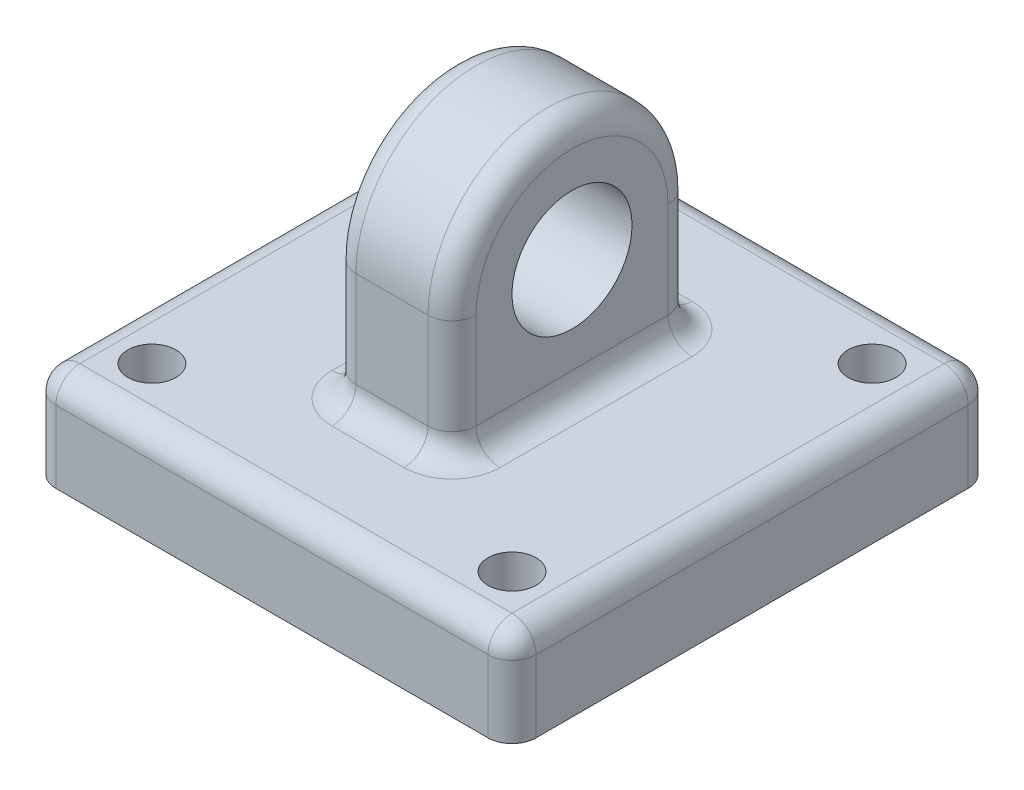
ISO-10303-21;
HEADER;
FILE_DESCRIPTION(('STEP AP214'),'2;1');
FILE_NAME('part.step','',(''),(''),'','','');
FILE_SCHEMA(('AUTOMOTIVE_DESIGN { 1 0 10303 214 1 1 1 1 }'));
ENDSEC;
DATA;
#1=APPLICATION_CONTEXT('core data for automotive mechanical design processes');
#2=APPLICATION_PROTOCOL_DEFINITION('international standard','automotive_design',2000,#1);
#3=PRODUCT_CONTEXT('',#1,'mechanical');
#4=PRODUCT('Part','Part','',(#3));
#5=PRODUCT_RELATED_PRODUCT_CATEGORY('part','',(#4));
#6=PRODUCT_DEFINITION_FORMATION('','',#4);
#7=PRODUCT_DEFINITION_CONTEXT('part definition',#1,'design');
#8=PRODUCT_DEFINITION('design','',#6,#7);
#9=PRODUCT_DEFINITION_SHAPE('','',#8);
#10=(LENGTH_UNIT() NAMED_UNIT(*) SI_UNIT(.MILLI.,.METRE.));
#11=(NAMED_UNIT(*) PLANE_ANGLE_UNIT() SI_UNIT($,.RADIAN.));
#12=(NAMED_UNIT(*) SI_UNIT($,.STERADIAN.) SOLID_ANGLE_UNIT());
#13=UNCERTAINTY_MEASURE_WITH_UNIT(LENGTH_MEASURE(1.E-05),#10,'distance_accuracy_value','');
#14=(GEOMETRIC_REPRESENTATION_CONTEXT(3) GLOBAL_UNCERTAINTY_ASSIGNED_CONTEXT((#13)) GLOBAL_UNIT_ASSIGNED_CONTEXT((#10,
#11,#12)) REPRESENTATION_CONTEXT('',''));
#15=CARTESIAN_POINT('',(0.,0.,0.));
#16=DIRECTION('',(0.,0.,1.));
#17=DIRECTION('',(1.,0.,0.));
#18=AXIS2_PLACEMENT_3D('',#15,#16,#17);
#19=CARTESIAN_POINT('',(0.,-5.,0.));
#20=DIRECTION('',(0.,1.,0.));
#21=DIRECTION('',(0.,0.,1.));
#22=AXIS2_PLACEMENT_3D('',#19,#20,#21);
#23=PLANE('',#22);
#24=CARTESIAN_POINT('',(7.5,-5.,7.5));
#25=DIRECTION('',(0.,1.,0.));
#26=DIRECTION('',(0.,0.,1.));
#27=AXIS2_PLACEMENT_3D('',#24,#25,#26);
#28=CIRCLE('',#27,1.);
#29=CARTESIAN_POINT('',(7.5,-5.,8.5));
#30=VERTEX_POINT('',#29);
#31=EDGE_CURVE('E408',#30,#30,#28,.T.);
#32=ORIENTED_EDGE('',*,*,#31,.F.);
#33=EDGE_LOOP('',(#32));
#34=FACE_BOUND('',#33,.T.);
#35=CARTESIAN_POINT('',(7.5,-5.,-7.5));
#36=DIRECTION('',(0.,1.,0.));
#37=DIRECTION('',(0.,0.,1.));
#38=AXIS2_PLACEMENT_3D('',#35,#36,#37);
#39=CIRCLE('',#38,1.);
#40=CARTESIAN_POINT('',(7.5,-5.,-6.5));
#41=VERTEX_POINT('',#40);
#42=EDGE_CURVE('E895',#41,#41,#39,.T.);
#43=ORIENTED_EDGE('',*,*,#42,.F.);
#44=EDGE_LOOP('',(#43));
#45=FACE_BOUND('',#44,.T.);
#46=CARTESIAN_POINT('',(-7.5,-5.,-7.5));
#47=DIRECTION('',(0.,1.,0.));
#48=DIRECTION('',(0.,0.,1.));
#49=AXIS2_PLACEMENT_3D('',#46,#47,#48);
#50=CIRCLE('',#49,1.);
#51=CARTESIAN_POINT('',(-7.5,-5.,-6.5));
#52=VERTEX_POINT('',#51);
#53=EDGE_CURVE('E901',#52,#52,#50,.T.);
#54=ORIENTED_EDGE('',*,*,#53,.F.);
#55=EDGE_LOOP('',(#54));
#56=FACE_BOUND('',#55,.T.);
#57=CARTESIAN_POINT('',(-7.5,-5.,7.5));
#58=DIRECTION('',(0.,1.,0.));
#59=DIRECTION('',(0.,0.,1.));
#60=AXIS2_PLACEMENT_3D('',#57,#58,#59);
#61=CIRCLE('',#60,1.);
#62=CARTESIAN_POINT('',(-7.5,-5.,8.5));
#63=VERTEX_POINT('',#62);
#64=EDGE_CURVE('E349',#63,#63,#61,.T.);
#65=ORIENTED_EDGE('',*,*,#64,.F.);
#66=EDGE_LOOP('',(#65));
#67=FACE_BOUND('',#66,.T.);
#68=DIRECTION('',(0.,0.,1.));
#69=VECTOR('',#68,1.);
#70=CARTESIAN_POINT('',(9.,-5.,-10.));
#71=LINE('',#70,#69);
#72=CARTESIAN_POINT('',(9.,-5.,9.));
#73=VERTEX_POINT('',#72);
#74=CARTESIAN_POINT('',(9.,-5.,-9.));
#75=VERTEX_POINT('',#74);
#76=EDGE_CURVE('E230',#73,#75,#71,.F.);
#77=ORIENTED_EDGE('',*,*,#76,.T.);
#78=DIRECTION('',(1.,0.,0.));
#79=VECTOR('',#78,1.);
#80=CARTESIAN_POINT('',(-10.,-5.,-9.));
#81=LINE('',#80,#79);
#82=CARTESIAN_POINT('',(-9.,-5.,-9.));
#83=VERTEX_POINT('',#82);
#84=EDGE_CURVE('E236',#75,#83,#81,.F.);
#85=ORIENTED_EDGE('',*,*,#84,.T.);
#86=DIRECTION('',(0.,0.,-1.));
#87=VECTOR('',#86,1.);
#88=CARTESIAN_POINT('',(-9.,-5.,10.));
#89=LINE('',#88,#87);
#90=CARTESIAN_POINT('',(-9.,-5.,9.));
#91=VERTEX_POINT('',#90);
#92=EDGE_CURVE('E234',#83,#91,#89,.F.);
#93=ORIENTED_EDGE('',*,*,#92,.T.);
#94=DIRECTION('',(-1.,0.,0.));
#95=VECTOR('',#94,1.);
#96=CARTESIAN_POINT('',(10.,-5.,9.));
#97=LINE('',#96,#95);
#98=EDGE_CURVE('E232',#91,#73,#97,.F.);
#99=ORIENTED_EDGE('',*,*,#98,.T.);
#100=EDGE_LOOP('',(#77,#85,#93,#99));
#101=FACE_BOUND('',#100,.T.);
#102=CARTESIAN_POINT('',(-1.5,-5.,-4.));
#103=DIRECTION('',(0.,1.,0.));
#104=DIRECTION('',(0.,0.,1.));
#105=AXIS2_PLACEMENT_3D('',#102,#103,#104);
#106=CIRCLE('',#105,2.);
#107=CARTESIAN_POINT('',(-1.5,-5.,-6.));
#108=VERTEX_POINT('',#107);
#109=CARTESIAN_POINT('',(-3.5,-5.,-4.));
#110=VERTEX_POINT('',#109);
#111=EDGE_CURVE('E257',#108,#110,#106,.T.);
#112=ORIENTED_EDGE('',*,*,#111,.F.);
#113=DIRECTION('',(-1.,0.,0.));
#114=VECTOR('',#113,1.);
#115=CARTESIAN_POINT('',(0.,-5.,-6.));
#116=LINE('',#115,#114);
#117=CARTESIAN_POINT('',(1.5,-5.,-6.));
#118=VERTEX_POINT('',#117);
#119=EDGE_CURVE('E254',#108,#118,#116,.F.);
#120=ORIENTED_EDGE('',*,*,#119,.T.);
#121=CARTESIAN_POINT('',(1.5,-5.,-4.));
#122=DIRECTION('',(0.,1.,0.));
#123=DIRECTION('',(0.,0.,1.));
#124=AXIS2_PLACEMENT_3D('',#121,#122,#123);
#125=CIRCLE('',#124,2.);
#126=CARTESIAN_POINT('',(3.5,-5.,-4.));
#127=VERTEX_POINT('',#126);
#128=EDGE_CURVE('E251',#127,#118,#125,.T.);
#129=ORIENTED_EDGE('',*,*,#128,.F.);
#130=DIRECTION('',(0.,0.,-1.));
#131=VECTOR('',#130,1.);
#132=CARTESIAN_POINT('',(3.5,-5.,5.));
#133=LINE('',#132,#131);
#134=CARTESIAN_POINT('',(3.5,-5.,4.));
#135=VERTEX_POINT('',#134);
#136=EDGE_CURVE('E249',#127,#135,#133,.F.);
#137=ORIENTED_EDGE('',*,*,#136,.T.);
#138=CARTESIAN_POINT('',(1.5,-5.,4.));
#139=DIRECTION('',(0.,1.,0.));
#140=DIRECTION('',(0.,0.,1.));
#141=AXIS2_PLACEMENT_3D('',#138,#139,#140);
#142=CIRCLE('',#141,2.);
#143=CARTESIAN_POINT('',(1.5,-5.,6.));
#144=VERTEX_POINT('',#143);
#145=EDGE_CURVE('E246',#144,#135,#142,.T.);
#146=ORIENTED_EDGE('',*,*,#145,.F.);
#147=DIRECTION('',(-1.,0.,0.));
#148=VECTOR('',#147,1.);
#149=CARTESIAN_POINT('',(0.,-5.,6.));
#150=LINE('',#149,#148);
#151=CARTESIAN_POINT('',(-1.5,-5.,6.));
#152=VERTEX_POINT('',#151);
#153=EDGE_CURVE('E242',#144,#152,#150,.T.);
#154=ORIENTED_EDGE('',*,*,#153,.T.);
#155=CARTESIAN_POINT('',(-1.5,-5.,4.));
#156=DIRECTION('',(0.,1.,0.));
#157=DIRECTION('',(0.,0.,1.));
#158=AXIS2_PLACEMENT_3D('',#155,#156,#157);
#159=CIRCLE('',#158,2.);
#160=CARTESIAN_POINT('',(-3.5,-5.,4.));
#161=VERTEX_POINT('',#160);
#162=EDGE_CURVE('E239',#161,#152,#159,.T.);
#163=ORIENTED_EDGE('',*,*,#162,.F.);
#164=DIRECTION('',(0.,0.,-1.));
#165=VECTOR('',#164,1.);
#166=CARTESIAN_POINT('',(-3.5,-5.,0.));
#167=LINE('',#166,#165);
#168=EDGE_CURVE('E244',#161,#110,#167,.T.);
#169=ORIENTED_EDGE('',*,*,#168,.T.);
#170=EDGE_LOOP('',(#112,#120,#129,#137,#146,#154,#163,#169));
#171=FACE_BOUND('',#170,.T.);
#172=ADVANCED_FACE('F37',(#34,#45,#56,#67,#101,#171),#23,.T.);
#173=CARTESIAN_POINT('',(2.5,0.,0.));
#174=DIRECTION('',(1.,0.,0.));
#175=DIRECTION('',(0.,0.,-1.));
#176=AXIS2_PLACEMENT_3D('',#173,#174,#175);
#177=PLANE('',#176);
#178=DIRECTION('',(0.,-1.,0.));
#179=VECTOR('',#178,1.);
#180=CARTESIAN_POINT('',(2.5,-5.,4.));
#181=LINE('',#180,#179);
#182=CARTESIAN_POINT('',(2.5,0.,4.));
#183=VERTEX_POINT('',#182);
#184=CARTESIAN_POINT('',(2.5,-4.,4.));
#185=VERTEX_POINT('',#184);
#186=EDGE_CURVE('E260',#183,#185,#181,.T.);
#187=ORIENTED_EDGE('',*,*,#186,.T.);
#188=DIRECTION('',(0.,0.,-1.));
#189=VECTOR('',#188,1.);
#190=CARTESIAN_POINT('',(2.5,-4.,-5.));
#191=LINE('',#190,#189);
#192=CARTESIAN_POINT('',(2.5,-4.,-4.));
#193=VERTEX_POINT('',#192);
#194=EDGE_CURVE('E265',#185,#193,#191,.T.);
#195=ORIENTED_EDGE('',*,*,#194,.T.);
#196=DIRECTION('',(0.,1.,0.));
#197=VECTOR('',#196,1.);
#198=CARTESIAN_POINT('',(2.5,0.,-4.));
#199=LINE('',#198,#197);
#200=CARTESIAN_POINT('',(2.5,0.,-4.));
#201=VERTEX_POINT('',#200);
#202=EDGE_CURVE('E263',#193,#201,#199,.T.);
#203=ORIENTED_EDGE('',*,*,#202,.T.);
#204=CARTESIAN_POINT('',(2.5,0.,0.));
#205=DIRECTION('',(1.,0.,0.));
#206=DIRECTION('',(0.,0.,-1.));
#207=AXIS2_PLACEMENT_3D('',#204,#205,#206);
#208=CIRCLE('',#207,4.);
#209=EDGE_CURVE('E215',#201,#183,#208,.T.);
#210=ORIENTED_EDGE('',*,*,#209,.T.);
#211=EDGE_LOOP('',(#187,#195,#203,#210));
#212=FACE_BOUND('',#211,.T.);
#213=CARTESIAN_POINT('',(2.5,0.,0.));
#214=DIRECTION('',(1.,0.,0.));
#215=DIRECTION('',(0.,0.,-1.));
#216=AXIS2_PLACEMENT_3D('',#213,#214,#215);
#217=CIRCLE('',#216,2.5);
#218=CARTESIAN_POINT('',(2.5,0.,-2.5));
#219=VERTEX_POINT('',#218);
#220=EDGE_CURVE('E209',#219,#219,#217,.T.);
#221=ORIENTED_EDGE('',*,*,#220,.F.);
#222=EDGE_LOOP('',(#221));
#223=FACE_BOUND('',#222,.T.);
#224=ADVANCED_FACE('F437',(#212,#223),#177,.T.);
#225=CARTESIAN_POINT('',(-2.5,0.,0.));
#226=DIRECTION('',(1.,0.,0.));
#227=DIRECTION('',(0.,0.,-1.));
#228=AXIS2_PLACEMENT_3D('',#225,#226,#227);
#229=PLANE('',#228);
#230=DIRECTION('',(0.,1.,0.));
#231=VECTOR('',#230,1.);
#232=CARTESIAN_POINT('',(-2.5,0.,-4.));
#233=LINE('',#232,#231);
#234=CARTESIAN_POINT('',(-2.5,0.,-4.));
#235=VERTEX_POINT('',#234);
#236=CARTESIAN_POINT('',(-2.5,-4.,-4.));
#237=VERTEX_POINT('',#236);
#238=EDGE_CURVE('E272',#235,#237,#233,.F.);
#239=ORIENTED_EDGE('',*,*,#238,.T.);
#240=DIRECTION('',(0.,0.,-1.));
#241=VECTOR('',#240,1.);
#242=CARTESIAN_POINT('',(-2.5,-4.,0.));
#243=LINE('',#242,#241);
#244=CARTESIAN_POINT('',(-2.5,-4.,4.));
#245=VERTEX_POINT('',#244);
#246=EDGE_CURVE('E199',#237,#245,#243,.F.);
#247=ORIENTED_EDGE('',*,*,#246,.T.);
#248=DIRECTION('',(0.,-1.,0.));
#249=VECTOR('',#248,1.);
#250=CARTESIAN_POINT('',(-2.5,0.,4.));
#251=LINE('',#250,#249);
#252=CARTESIAN_POINT('',(-2.5,0.,4.));
#253=VERTEX_POINT('',#252);
#254=EDGE_CURVE('E268',#245,#253,#251,.F.);
#255=ORIENTED_EDGE('',*,*,#254,.T.);
#256=CARTESIAN_POINT('',(-2.5,0.,0.));
#257=DIRECTION('',(1.,0.,0.));
#258=DIRECTION('',(0.,0.,-1.));
#259=AXIS2_PLACEMENT_3D('',#256,#257,#258);
#260=CIRCLE('',#259,4.);
#261=EDGE_CURVE('E270',#253,#235,#260,.F.);
#262=ORIENTED_EDGE('',*,*,#261,.T.);
#263=EDGE_LOOP('',(#239,#247,#255,#262));
#264=FACE_BOUND('',#263,.T.);
#265=CARTESIAN_POINT('',(-2.5,0.,0.));
#266=DIRECTION('',(1.,0.,0.));
#267=DIRECTION('',(0.,0.,-1.));
#268=AXIS2_PLACEMENT_3D('',#265,#266,#267);
#269=CIRCLE('',#268,2.5);
#270=CARTESIAN_POINT('',(-2.5,0.,-2.5));
#271=VERTEX_POINT('',#270);
#272=EDGE_CURVE('E415',#271,#271,#269,.T.);
#273=ORIENTED_EDGE('',*,*,#272,.T.);
#274=EDGE_LOOP('',(#273));
#275=FACE_BOUND('',#274,.T.);
#276=ADVANCED_FACE('F421',(#264,#275),#229,.F.);
#277=CARTESIAN_POINT('',(2.5,0.,0.));
#278=DIRECTION('',(-1.,0.,0.));
#279=DIRECTION('',(0.,0.,1.));
#280=AXIS2_PLACEMENT_3D('',#277,#278,#279);
#281=CYLINDRICAL_SURFACE('',#280,5.);
#282=DIRECTION('',(-1.,0.,0.));
#283=VECTOR('',#282,1.);
#284=CARTESIAN_POINT('',(2.5,0.,-5.));
#285=LINE('',#284,#283);
#286=CARTESIAN_POINT('',(1.5,0.,-5.));
#287=VERTEX_POINT('',#286);
#288=CARTESIAN_POINT('',(-1.5,0.,-5.));
#289=VERTEX_POINT('',#288);
#290=EDGE_CURVE('E190',#287,#289,#285,.T.);
#291=ORIENTED_EDGE('',*,*,#290,.T.);
#292=CARTESIAN_POINT('',(-1.5,0.,0.));
#293=DIRECTION('',(1.,0.,0.));
#294=DIRECTION('',(0.,0.,-1.));
#295=AXIS2_PLACEMENT_3D('',#292,#293,#294);
#296=CIRCLE('',#295,5.);
#297=CARTESIAN_POINT('',(-1.5,0.,5.));
#298=VERTEX_POINT('',#297);
#299=EDGE_CURVE('E198',#289,#298,#296,.T.);
#300=ORIENTED_EDGE('',*,*,#299,.T.);
#301=DIRECTION('',(-1.,0.,0.));
#302=VECTOR('',#301,1.);
#303=CARTESIAN_POINT('',(2.5,0.,5.));
#304=LINE('',#303,#302);
#305=CARTESIAN_POINT('',(1.5,0.,5.));
#306=VERTEX_POINT('',#305);
#307=EDGE_CURVE('E193',#306,#298,#304,.T.);
#308=ORIENTED_EDGE('',*,*,#307,.F.);
#309=CARTESIAN_POINT('',(1.5,0.,0.));
#310=DIRECTION('',(1.,0.,0.));
#311=DIRECTION('',(0.,0.,-1.));
#312=AXIS2_PLACEMENT_3D('',#309,#310,#311);
#313=CIRCLE('',#312,5.);
#314=EDGE_CURVE('E187',#306,#287,#313,.F.);
#315=ORIENTED_EDGE('',*,*,#314,.T.);
#316=EDGE_LOOP('',(#291,#300,#308,#315));
#317=FACE_BOUND('',#316,.T.);
#318=ADVANCED_FACE('F189',(#317),#281,.T.);
#319=CARTESIAN_POINT('',(2.5,0.,5.));
#320=DIRECTION('',(0.,0.,-1.));
#321=DIRECTION('',(0.,1.,0.));
#322=AXIS2_PLACEMENT_3D('',#319,#320,#321);
#323=PLANE('',#322);
#324=ORIENTED_EDGE('',*,*,#307,.T.);
#325=DIRECTION('',(0.,-1.,0.));
#326=VECTOR('',#325,1.);
#327=CARTESIAN_POINT('',(-1.5,0.,5.));
#328=LINE('',#327,#326);
#329=CARTESIAN_POINT('',(-1.5,-4.,5.));
#330=VERTEX_POINT('',#329);
#331=EDGE_CURVE('E281',#298,#330,#328,.T.);
#332=ORIENTED_EDGE('',*,*,#331,.T.);
#333=DIRECTION('',(-1.,0.,0.));
#334=VECTOR('',#333,1.);
#335=CARTESIAN_POINT('',(2.5,-4.,5.));
#336=LINE('',#335,#334);
#337=CARTESIAN_POINT('',(1.5,-4.,5.));
#338=VERTEX_POINT('',#337);
#339=EDGE_CURVE('E279',#330,#338,#336,.F.);
#340=ORIENTED_EDGE('',*,*,#339,.T.);
#341=DIRECTION('',(0.,-1.,0.));
#342=VECTOR('',#341,1.);
#343=CARTESIAN_POINT('',(1.5,0.,5.));
#344=LINE('',#343,#342);
#345=EDGE_CURVE('E277',#338,#306,#344,.F.);
#346=ORIENTED_EDGE('',*,*,#345,.T.);
#347=EDGE_LOOP('',(#324,#332,#340,#346));
#348=FACE_BOUND('',#347,.T.);
#349=ADVANCED_FACE('F433',(#348),#323,.F.);
#350=CARTESIAN_POINT('',(2.5,0.,-5.));
#351=DIRECTION('',(0.,0.,1.));
#352=DIRECTION('',(1.,0.,0.));
#353=AXIS2_PLACEMENT_3D('',#350,#351,#352);
#354=PLANE('',#353);
#355=DIRECTION('',(-1.,0.,0.));
#356=VECTOR('',#355,1.);
#357=CARTESIAN_POINT('',(2.5,-4.,-5.));
#358=LINE('',#357,#356);
#359=CARTESIAN_POINT('',(1.5,-4.,-5.));
#360=VERTEX_POINT('',#359);
#361=CARTESIAN_POINT('',(-1.5,-4.,-5.));
#362=VERTEX_POINT('',#361);
#363=EDGE_CURVE('E224',#360,#362,#358,.T.);
#364=ORIENTED_EDGE('',*,*,#363,.T.);
#365=DIRECTION('',(0.,1.,0.));
#366=VECTOR('',#365,1.);
#367=CARTESIAN_POINT('',(-1.5,0.,-5.));
#368=LINE('',#367,#366);
#369=EDGE_CURVE('E208',#362,#289,#368,.T.);
#370=ORIENTED_EDGE('',*,*,#369,.T.);
#371=ORIENTED_EDGE('',*,*,#290,.F.);
#372=DIRECTION('',(0.,1.,0.));
#373=VECTOR('',#372,1.);
#374=CARTESIAN_POINT('',(1.5,-5.,-5.));
#375=LINE('',#374,#373);
#376=EDGE_CURVE('E205',#287,#360,#375,.F.);
#377=ORIENTED_EDGE('',*,*,#376,.T.);
#378=EDGE_LOOP('',(#364,#370,#371,#377));
#379=FACE_BOUND('',#378,.T.);
#380=ADVANCED_FACE('F203',(#379),#354,.F.);
#381=CARTESIAN_POINT('',(2.5,0.,0.));
#382=DIRECTION('',(-1.,0.,0.));
#383=DIRECTION('',(0.,0.,1.));
#384=AXIS2_PLACEMENT_3D('',#381,#382,#383);
#385=CYLINDRICAL_SURFACE('',#384,2.5);
#386=ORIENTED_EDGE('',*,*,#220,.T.);
#387=EDGE_LOOP('',(#386));
#388=FACE_BOUND('',#387,.T.);
#389=ORIENTED_EDGE('',*,*,#272,.F.);
#390=EDGE_LOOP('',(#389));
#391=FACE_BOUND('',#390,.T.);
#392=ADVANCED_FACE('F423',(#388,#391),#385,.F.);
#393=CARTESIAN_POINT('',(-10.,-9.,-10.));
#394=DIRECTION('',(1.,0.,0.));
#395=DIRECTION('',(0.,0.,-1.));
#396=AXIS2_PLACEMENT_3D('',#393,#394,#395);
#397=PLANE('',#396);
#398=DIRECTION('',(0.,0.,-1.));
#399=VECTOR('',#398,1.);
#400=CARTESIAN_POINT('',(-10.,-9.,-10.));
#401=LINE('',#400,#399);
#402=CARTESIAN_POINT('',(-10.,-9.,9.));
#403=VERTEX_POINT('',#402);
#404=CARTESIAN_POINT('',(-10.,-9.,-9.));
#405=VERTEX_POINT('',#404);
#406=EDGE_CURVE('E394',#403,#405,#401,.T.);
#407=ORIENTED_EDGE('',*,*,#406,.F.);
#408=DIRECTION('',(0.,1.,0.));
#409=VECTOR('',#408,1.);
#410=CARTESIAN_POINT('',(-10.,-9.,9.));
#411=LINE('',#410,#409);
#412=CARTESIAN_POINT('',(-10.,-6.,9.));
#413=VERTEX_POINT('',#412);
#414=EDGE_CURVE('E308',#403,#413,#411,.T.);
#415=ORIENTED_EDGE('',*,*,#414,.T.);
#416=DIRECTION('',(0.,0.,-1.));
#417=VECTOR('',#416,1.);
#418=CARTESIAN_POINT('',(-10.,-6.,-10.));
#419=LINE('',#418,#417);
#420=CARTESIAN_POINT('',(-10.,-6.,-9.));
#421=VERTEX_POINT('',#420);
#422=EDGE_CURVE('E304',#413,#421,#419,.T.);
#423=ORIENTED_EDGE('',*,*,#422,.T.);
#424=DIRECTION('',(0.,1.,0.));
#425=VECTOR('',#424,1.);
#426=CARTESIAN_POINT('',(-10.,-9.,-9.));
#427=LINE('',#426,#425);
#428=EDGE_CURVE('E306',#421,#405,#427,.F.);
#429=ORIENTED_EDGE('',*,*,#428,.T.);
#430=EDGE_LOOP('',(#407,#415,#423,#429));
#431=FACE_BOUND('',#430,.T.);
#432=ADVANCED_FACE('F393',(#431),#397,.F.);
#433=CARTESIAN_POINT('',(-10.,-9.,-10.));
#434=DIRECTION('',(0.,0.,1.));
#435=DIRECTION('',(1.,0.,0.));
#436=AXIS2_PLACEMENT_3D('',#433,#434,#435);
#437=PLANE('',#436);
#438=DIRECTION('',(1.,0.,0.));
#439=VECTOR('',#438,1.);
#440=CARTESIAN_POINT('',(-10.,-9.,-10.));
#441=LINE('',#440,#439);
#442=CARTESIAN_POINT('',(-9.,-9.,-10.));
#443=VERTEX_POINT('',#442);
#444=CARTESIAN_POINT('',(9.,-9.,-10.));
#445=VERTEX_POINT('',#444);
#446=EDGE_CURVE('E402',#443,#445,#441,.T.);
#447=ORIENTED_EDGE('',*,*,#446,.F.);
#448=DIRECTION('',(0.,1.,0.));
#449=VECTOR('',#448,1.);
#450=CARTESIAN_POINT('',(-9.,-9.,-10.));
#451=LINE('',#450,#449);
#452=CARTESIAN_POINT('',(-9.,-6.,-10.));
#453=VERTEX_POINT('',#452);
#454=EDGE_CURVE('E11',#443,#453,#451,.T.);
#455=ORIENTED_EDGE('',*,*,#454,.T.);
#456=DIRECTION('',(1.,0.,0.));
#457=VECTOR('',#456,1.);
#458=CARTESIAN_POINT('',(10.,-6.,-10.));
#459=LINE('',#458,#457);
#460=CARTESIAN_POINT('',(9.,-6.,-10.));
#461=VERTEX_POINT('',#460);
#462=EDGE_CURVE('E53',#453,#461,#459,.T.);
#463=ORIENTED_EDGE('',*,*,#462,.T.);
#464=DIRECTION('',(0.,1.,0.));
#465=VECTOR('',#464,1.);
#466=CARTESIAN_POINT('',(9.,-9.,-10.));
#467=LINE('',#466,#465);
#468=EDGE_CURVE('E46',#461,#445,#467,.F.);
#469=ORIENTED_EDGE('',*,*,#468,.T.);
#470=EDGE_LOOP('',(#447,#455,#463,#469));
#471=FACE_BOUND('',#470,.T.);
#472=ADVANCED_FACE('F431',(#471),#437,.F.);
#473=CARTESIAN_POINT('',(10.,-9.,-10.));
#474=DIRECTION('',(-1.,0.,0.));
#475=DIRECTION('',(0.,0.,1.));
#476=AXIS2_PLACEMENT_3D('',#473,#474,#475);
#477=PLANE('',#476);
#478=DIRECTION('',(0.,0.,1.));
#479=VECTOR('',#478,1.);
#480=CARTESIAN_POINT('',(10.,-6.,10.));
#481=LINE('',#480,#479);
#482=CARTESIAN_POINT('',(10.,-6.,-9.));
#483=VERTEX_POINT('',#482);
#484=CARTESIAN_POINT('',(10.,-6.,9.));
#485=VERTEX_POINT('',#484);
#486=EDGE_CURVE('E290',#483,#485,#481,.T.);
#487=ORIENTED_EDGE('',*,*,#486,.T.);
#488=DIRECTION('',(0.,1.,0.));
#489=VECTOR('',#488,1.);
#490=CARTESIAN_POINT('',(10.,-9.,9.));
#491=LINE('',#490,#489);
#492=CARTESIAN_POINT('',(10.,-9.,9.));
#493=VERTEX_POINT('',#492);
#494=EDGE_CURVE('E294',#485,#493,#491,.F.);
#495=ORIENTED_EDGE('',*,*,#494,.T.);
#496=DIRECTION('',(0.,0.,1.));
#497=VECTOR('',#496,1.);
#498=CARTESIAN_POINT('',(10.,-9.,-10.));
#499=LINE('',#498,#497);
#500=CARTESIAN_POINT('',(10.,-9.,-9.));
#501=VERTEX_POINT('',#500);
#502=EDGE_CURVE('E405',#501,#493,#499,.T.);
#503=ORIENTED_EDGE('',*,*,#502,.F.);
#504=DIRECTION('',(0.,1.,0.));
#505=VECTOR('',#504,1.);
#506=CARTESIAN_POINT('',(10.,-9.,-9.));
#507=LINE('',#506,#505);
#508=EDGE_CURVE('E292',#501,#483,#507,.T.);
#509=ORIENTED_EDGE('',*,*,#508,.T.);
#510=EDGE_LOOP('',(#487,#495,#503,#509));
#511=FACE_BOUND('',#510,.T.);
#512=ADVANCED_FACE('F452',(#511),#477,.F.);
#513=CARTESIAN_POINT('',(-10.,-9.,10.));
#514=DIRECTION('',(0.,0.,-1.));
#515=DIRECTION('',(-1.,0.,0.));
#516=AXIS2_PLACEMENT_3D('',#513,#514,#515);
#517=PLANE('',#516);
#518=DIRECTION('',(-1.,0.,0.));
#519=VECTOR('',#518,1.);
#520=CARTESIAN_POINT('',(-10.,-9.,10.));
#521=LINE('',#520,#519);
#522=CARTESIAN_POINT('',(9.,-9.,10.));
#523=VERTEX_POINT('',#522);
#524=CARTESIAN_POINT('',(-9.,-9.,10.));
#525=VERTEX_POINT('',#524);
#526=EDGE_CURVE('E413',#523,#525,#521,.T.);
#527=ORIENTED_EDGE('',*,*,#526,.F.);
#528=DIRECTION('',(0.,1.,0.));
#529=VECTOR('',#528,1.);
#530=CARTESIAN_POINT('',(9.,-9.,10.));
#531=LINE('',#530,#529);
#532=CARTESIAN_POINT('',(9.,-6.,10.));
#533=VERTEX_POINT('',#532);
#534=EDGE_CURVE('E287',#523,#533,#531,.T.);
#535=ORIENTED_EDGE('',*,*,#534,.T.);
#536=DIRECTION('',(-1.,0.,0.));
#537=VECTOR('',#536,1.);
#538=CARTESIAN_POINT('',(-10.,-6.,10.));
#539=LINE('',#538,#537);
#540=CARTESIAN_POINT('',(-9.,-6.,10.));
#541=VERTEX_POINT('',#540);
#542=EDGE_CURVE('E283',#533,#541,#539,.T.);
#543=ORIENTED_EDGE('',*,*,#542,.T.);
#544=DIRECTION('',(0.,1.,0.));
#545=VECTOR('',#544,1.);
#546=CARTESIAN_POINT('',(-9.,-9.,10.));
#547=LINE('',#546,#545);
#548=EDGE_CURVE('E285',#541,#525,#547,.F.);
#549=ORIENTED_EDGE('',*,*,#548,.T.);
#550=EDGE_LOOP('',(#527,#535,#543,#549));
#551=FACE_BOUND('',#550,.T.);
#552=ADVANCED_FACE('F449',(#551),#517,.F.);
#553=CARTESIAN_POINT('',(0.,-9.,0.));
#554=DIRECTION('',(0.,1.,0.));
#555=DIRECTION('',(0.,0.,1.));
#556=AXIS2_PLACEMENT_3D('',#553,#554,#555);
#557=PLANE('',#556);
#558=CARTESIAN_POINT('',(-7.5,-9.,7.5));
#559=DIRECTION('',(0.,1.,0.));
#560=DIRECTION('',(0.,0.,1.));
#561=AXIS2_PLACEMENT_3D('',#558,#559,#560);
#562=CIRCLE('',#561,1.);
#563=CARTESIAN_POINT('',(-7.5,-9.,8.5));
#564=VERTEX_POINT('',#563);
#565=EDGE_CURVE('E883',#564,#564,#562,.F.);
#566=ORIENTED_EDGE('',*,*,#565,.F.);
#567=EDGE_LOOP('',(#566));
#568=FACE_BOUND('',#567,.T.);
#569=CARTESIAN_POINT('',(-7.5,-9.,-7.5));
#570=DIRECTION('',(0.,1.,0.));
#571=DIRECTION('',(0.,0.,1.));
#572=AXIS2_PLACEMENT_3D('',#569,#570,#571);
#573=CIRCLE('',#572,1.);
#574=CARTESIAN_POINT('',(-7.5,-9.,-6.5));
#575=VERTEX_POINT('',#574);
#576=EDGE_CURVE('E887',#575,#575,#573,.F.);
#577=ORIENTED_EDGE('',*,*,#576,.F.);
#578=EDGE_LOOP('',(#577));
#579=FACE_BOUND('',#578,.T.);
#580=CARTESIAN_POINT('',(7.5,-9.,-7.5));
#581=DIRECTION('',(0.,1.,0.));
#582=DIRECTION('',(0.,0.,1.));
#583=AXIS2_PLACEMENT_3D('',#580,#581,#582);
#584=CIRCLE('',#583,1.);
#585=CARTESIAN_POINT('',(7.5,-9.,-6.5));
#586=VERTEX_POINT('',#585);
#587=EDGE_CURVE('E891',#586,#586,#584,.F.);
#588=ORIENTED_EDGE('',*,*,#587,.F.);
#589=EDGE_LOOP('',(#588));
#590=FACE_BOUND('',#589,.T.);
#591=CARTESIAN_POINT('',(7.5,-9.,7.5));
#592=DIRECTION('',(0.,1.,0.));
#593=DIRECTION('',(0.,0.,1.));
#594=AXIS2_PLACEMENT_3D('',#591,#592,#593);
#595=CIRCLE('',#594,1.);
#596=CARTESIAN_POINT('',(7.5,-9.,8.5));
#597=VERTEX_POINT('',#596);
#598=EDGE_CURVE('E403',#597,#597,#595,.F.);
#599=ORIENTED_EDGE('',*,*,#598,.F.);
#600=EDGE_LOOP('',(#599));
#601=FACE_BOUND('',#600,.T.);
#602=ORIENTED_EDGE('',*,*,#502,.T.);
#603=CARTESIAN_POINT('',(9.,-9.,9.));
#604=DIRECTION('',(0.,1.,0.));
#605=DIRECTION('',(0.,0.,1.));
#606=AXIS2_PLACEMENT_3D('',#603,#604,#605);
#607=CIRCLE('',#606,1.);
#608=EDGE_CURVE('E302',#493,#523,#607,.F.);
#609=ORIENTED_EDGE('',*,*,#608,.T.);
#610=ORIENTED_EDGE('',*,*,#526,.T.);
#611=CARTESIAN_POINT('',(-9.,-9.,9.));
#612=DIRECTION('',(0.,1.,0.));
#613=DIRECTION('',(0.,0.,1.));
#614=AXIS2_PLACEMENT_3D('',#611,#612,#613);
#615=CIRCLE('',#614,1.);
#616=EDGE_CURVE('E300',#525,#403,#615,.F.);
#617=ORIENTED_EDGE('',*,*,#616,.T.);
#618=ORIENTED_EDGE('',*,*,#406,.T.);
#619=CARTESIAN_POINT('',(-9.,-9.,-9.));
#620=DIRECTION('',(0.,1.,0.));
#621=DIRECTION('',(0.,0.,1.));
#622=AXIS2_PLACEMENT_3D('',#619,#620,#621);
#623=CIRCLE('',#622,1.);
#624=EDGE_CURVE('E298',#405,#443,#623,.F.);
#625=ORIENTED_EDGE('',*,*,#624,.T.);
#626=ORIENTED_EDGE('',*,*,#446,.T.);
#627=CARTESIAN_POINT('',(9.,-9.,-9.));
#628=DIRECTION('',(0.,1.,0.));
#629=DIRECTION('',(0.,0.,1.));
#630=AXIS2_PLACEMENT_3D('',#627,#628,#629);
#631=CIRCLE('',#630,1.);
#632=EDGE_CURVE('E296',#445,#501,#631,.F.);
#633=ORIENTED_EDGE('',*,*,#632,.T.);
#634=EDGE_LOOP('',(#602,#609,#610,#617,#618,#625,#626,#633));
#635=FACE_BOUND('',#634,.T.);
#636=ADVANCED_FACE('F398',(#568,#579,#590,#601,#635),#557,.F.);
#637=CARTESIAN_POINT('',(7.5,-9.001,7.5));
#638=DIRECTION('',(0.,1.,0.));
#639=DIRECTION('',(0.,0.,1.));
#640=AXIS2_PLACEMENT_3D('',#637,#638,#639);
#641=CYLINDRICAL_SURFACE('',#640,1.);
#642=ORIENTED_EDGE('',*,*,#31,.T.);
#643=EDGE_LOOP('',(#642));
#644=FACE_BOUND('',#643,.T.);
#645=ORIENTED_EDGE('',*,*,#598,.T.);
#646=EDGE_LOOP('',(#645));
#647=FACE_BOUND('',#646,.T.);
#648=ADVANCED_FACE('F757',(#644,#647),#641,.F.);
#649=CARTESIAN_POINT('',(7.5,-9.001,-7.5));
#650=DIRECTION('',(0.,1.,0.));
#651=DIRECTION('',(0.,0.,1.));
#652=AXIS2_PLACEMENT_3D('',#649,#650,#651);
#653=CYLINDRICAL_SURFACE('',#652,1.);
#654=ORIENTED_EDGE('',*,*,#42,.T.);
#655=EDGE_LOOP('',(#654));
#656=FACE_BOUND('',#655,.T.);
#657=ORIENTED_EDGE('',*,*,#587,.T.);
#658=EDGE_LOOP('',(#657));
#659=FACE_BOUND('',#658,.T.);
#660=ADVANCED_FACE('F748',(#656,#659),#653,.F.);
#661=CARTESIAN_POINT('',(-7.5,-9.001,-7.5));
#662=DIRECTION('',(0.,1.,0.));
#663=DIRECTION('',(0.,0.,1.));
#664=AXIS2_PLACEMENT_3D('',#661,#662,#663);
#665=CYLINDRICAL_SURFACE('',#664,1.);
#666=ORIENTED_EDGE('',*,*,#53,.T.);
#667=EDGE_LOOP('',(#666));
#668=FACE_BOUND('',#667,.T.);
#669=ORIENTED_EDGE('',*,*,#576,.T.);
#670=EDGE_LOOP('',(#669));
#671=FACE_BOUND('',#670,.T.);
#672=ADVANCED_FACE('F739',(#668,#671),#665,.F.);
#673=CARTESIAN_POINT('',(-7.5,-9.001,7.5));
#674=DIRECTION('',(0.,1.,0.));
#675=DIRECTION('',(0.,0.,1.));
#676=AXIS2_PLACEMENT_3D('',#673,#674,#675);
#677=CYLINDRICAL_SURFACE('',#676,1.);
#678=ORIENTED_EDGE('',*,*,#64,.T.);
#679=EDGE_LOOP('',(#678));
#680=FACE_BOUND('',#679,.T.);
#681=ORIENTED_EDGE('',*,*,#565,.T.);
#682=EDGE_LOOP('',(#681));
#683=FACE_BOUND('',#682,.T.);
#684=ADVANCED_FACE('F574',(#680,#683),#677,.F.);
#685=CARTESIAN_POINT('',(1.5,0.,4.));
#686=DIRECTION('',(0.,1.,0.));
#687=DIRECTION('',(0.,0.,1.));
#688=AXIS2_PLACEMENT_3D('',#685,#686,#687);
#689=CYLINDRICAL_SURFACE('',#688,1.);
#690=CARTESIAN_POINT('',(1.5,0.,4.));
#691=DIRECTION('',(0.,1.,0.));
#692=DIRECTION('',(0.,0.,1.));
#693=AXIS2_PLACEMENT_3D('',#690,#691,#692);
#694=CIRCLE('',#693,1.);
#695=EDGE_CURVE('E341',#306,#183,#694,.T.);
#696=ORIENTED_EDGE('',*,*,#695,.F.);
#697=ORIENTED_EDGE('',*,*,#345,.F.);
#698=CARTESIAN_POINT('',(1.5,-4.,4.));
#699=DIRECTION('',(0.,1.,0.));
#700=DIRECTION('',(0.,0.,1.));
#701=AXIS2_PLACEMENT_3D('',#698,#699,#700);
#702=CIRCLE('',#701,1.);
#703=EDGE_CURVE('E343',#185,#338,#702,.F.);
#704=ORIENTED_EDGE('',*,*,#703,.F.);
#705=ORIENTED_EDGE('',*,*,#186,.F.);
#706=EDGE_LOOP('',(#696,#697,#704,#705));
#707=FACE_BOUND('',#706,.T.);
#708=ADVANCED_FACE('F570',(#707),#689,.T.);
#709=CARTESIAN_POINT('',(-1.5,0.,4.));
#710=DIRECTION('',(0.,-1.,0.));
#711=DIRECTION('',(0.,0.,-1.));
#712=AXIS2_PLACEMENT_3D('',#709,#710,#711);
#713=CYLINDRICAL_SURFACE('',#712,1.);
#714=CARTESIAN_POINT('',(-1.5,-4.,4.));
#715=DIRECTION('',(0.,1.,0.));
#716=DIRECTION('',(0.,0.,1.));
#717=AXIS2_PLACEMENT_3D('',#714,#715,#716);
#718=CIRCLE('',#717,1.);
#719=EDGE_CURVE('E335',#330,#245,#718,.F.);
#720=ORIENTED_EDGE('',*,*,#719,.F.);
#721=ORIENTED_EDGE('',*,*,#331,.F.);
#722=CARTESIAN_POINT('',(-1.5,0.,4.));
#723=DIRECTION('',(0.,1.,0.));
#724=DIRECTION('',(0.,0.,1.));
#725=AXIS2_PLACEMENT_3D('',#722,#723,#724);
#726=CIRCLE('',#725,1.);
#727=EDGE_CURVE('E338',#253,#298,#726,.T.);
#728=ORIENTED_EDGE('',*,*,#727,.F.);
#729=ORIENTED_EDGE('',*,*,#254,.F.);
#730=EDGE_LOOP('',(#720,#721,#728,#729));
#731=FACE_BOUND('',#730,.T.);
#732=ADVANCED_FACE('F566',(#731),#713,.T.);
#733=CARTESIAN_POINT('',(0.,-4.,6.));
#734=DIRECTION('',(-1.,0.,0.));
#735=DIRECTION('',(0.,0.,1.));
#736=AXIS2_PLACEMENT_3D('',#733,#734,#735);
#737=CYLINDRICAL_SURFACE('',#736,1.);
#738=CARTESIAN_POINT('',(-1.5,-4.,6.));
#739=DIRECTION('',(1.,0.,0.));
#740=DIRECTION('',(0.,0.,-1.));
#741=AXIS2_PLACEMENT_3D('',#738,#739,#740);
#742=CIRCLE('',#741,1.);
#743=EDGE_CURVE('E332',#152,#330,#742,.T.);
#744=ORIENTED_EDGE('',*,*,#743,.F.);
#745=ORIENTED_EDGE('',*,*,#153,.F.);
#746=CARTESIAN_POINT('',(1.5,-4.,6.));
#747=DIRECTION('',(-1.,0.,0.));
#748=DIRECTION('',(0.,0.,1.));
#749=AXIS2_PLACEMENT_3D('',#746,#747,#748);
#750=CIRCLE('',#749,1.);
#751=EDGE_CURVE('E346',#338,#144,#750,.T.);
#752=ORIENTED_EDGE('',*,*,#751,.F.);
#753=ORIENTED_EDGE('',*,*,#339,.F.);
#754=EDGE_LOOP('',(#744,#745,#752,#753));
#755=FACE_BOUND('',#754,.T.);
#756=ADVANCED_FACE('F562',(#755),#737,.F.);
#757=CARTESIAN_POINT('',(1.5,-4.,4.));
#758=DIRECTION('',(0.,1.,0.));
#759=DIRECTION('',(0.,0.,1.));
#760=AXIS2_PLACEMENT_3D('',#757,#758,#759);
#761=TOROIDAL_SURFACE('',#760,2.,1.);
#762=ORIENTED_EDGE('',*,*,#751,.T.);
#763=ORIENTED_EDGE('',*,*,#145,.T.);
#764=CARTESIAN_POINT('',(3.5,-4.,4.));
#765=DIRECTION('',(0.,0.,-1.));
#766=DIRECTION('',(-1.,0.,0.));
#767=AXIS2_PLACEMENT_3D('',#764,#765,#766);
#768=CIRCLE('',#767,1.);
#769=EDGE_CURVE('E218',#185,#135,#768,.F.);
#770=ORIENTED_EDGE('',*,*,#769,.F.);
#771=ORIENTED_EDGE('',*,*,#703,.T.);
#772=EDGE_LOOP('',(#762,#763,#770,#771));
#773=FACE_BOUND('',#772,.T.);
#774=ADVANCED_FACE('F559',(#773),#761,.F.);
#775=CARTESIAN_POINT('',(1.5,0.,0.));
#776=DIRECTION('',(1.,0.,0.));
#777=DIRECTION('',(0.,0.,-1.));
#778=AXIS2_PLACEMENT_3D('',#775,#776,#777);
#779=TOROIDAL_SURFACE('',#778,4.,1.);
#780=ORIENTED_EDGE('',*,*,#695,.T.);
#781=ORIENTED_EDGE('',*,*,#209,.F.);
#782=CARTESIAN_POINT('',(1.5,0.,-4.));
#783=DIRECTION('',(0.,-1.,0.));
#784=DIRECTION('',(0.,0.,-1.));
#785=AXIS2_PLACEMENT_3D('',#782,#783,#784);
#786=CIRCLE('',#785,1.);
#787=EDGE_CURVE('E213',#287,#201,#786,.T.);
#788=ORIENTED_EDGE('',*,*,#787,.F.);
#789=ORIENTED_EDGE('',*,*,#314,.F.);
#790=EDGE_LOOP('',(#780,#781,#788,#789));
#791=FACE_BOUND('',#790,.T.);
#792=ADVANCED_FACE('F214',(#791),#779,.T.);
#793=CARTESIAN_POINT('',(-1.5,0.,0.));
#794=DIRECTION('',(1.,0.,0.));
#795=DIRECTION('',(0.,0.,-1.));
#796=AXIS2_PLACEMENT_3D('',#793,#794,#795);
#797=TOROIDAL_SURFACE('',#796,4.,1.);
#798=ORIENTED_EDGE('',*,*,#727,.T.);
#799=ORIENTED_EDGE('',*,*,#299,.F.);
#800=CARTESIAN_POINT('',(-1.5,0.,-4.));
#801=DIRECTION('',(0.,-1.,0.));
#802=DIRECTION('',(0.,0.,-1.));
#803=AXIS2_PLACEMENT_3D('',#800,#801,#802);
#804=CIRCLE('',#803,1.);
#805=EDGE_CURVE('E219',#235,#289,#804,.T.);
#806=ORIENTED_EDGE('',*,*,#805,.F.);
#807=ORIENTED_EDGE('',*,*,#261,.F.);
#808=EDGE_LOOP('',(#798,#799,#806,#807));
#809=FACE_BOUND('',#808,.T.);
#810=ADVANCED_FACE('F552',(#809),#797,.T.);
#811=CARTESIAN_POINT('',(-1.5,-4.,4.));
#812=DIRECTION('',(0.,1.,0.));
#813=DIRECTION('',(0.,0.,1.));
#814=AXIS2_PLACEMENT_3D('',#811,#812,#813);
#815=TOROIDAL_SURFACE('',#814,2.,1.);
#816=ORIENTED_EDGE('',*,*,#743,.T.);
#817=ORIENTED_EDGE('',*,*,#719,.T.);
#818=CARTESIAN_POINT('',(-3.5,-4.,4.));
#819=DIRECTION('',(0.,0.,-1.));
#820=DIRECTION('',(-1.,0.,0.));
#821=AXIS2_PLACEMENT_3D('',#818,#819,#820);
#822=CIRCLE('',#821,1.);
#823=EDGE_CURVE('E326',#161,#245,#822,.F.);
#824=ORIENTED_EDGE('',*,*,#823,.F.);
#825=ORIENTED_EDGE('',*,*,#162,.T.);
#826=EDGE_LOOP('',(#816,#817,#824,#825));
#827=FACE_BOUND('',#826,.T.);
#828=ADVANCED_FACE('F548',(#827),#815,.F.);
#829=CARTESIAN_POINT('',(3.5,-4.,0.));
#830=DIRECTION('',(0.,0.,1.));
#831=DIRECTION('',(1.,0.,0.));
#832=AXIS2_PLACEMENT_3D('',#829,#830,#831);
#833=CYLINDRICAL_SURFACE('',#832,1.);
#834=ORIENTED_EDGE('',*,*,#769,.T.);
#835=ORIENTED_EDGE('',*,*,#136,.F.);
#836=CARTESIAN_POINT('',(3.5,-4.,-4.));
#837=DIRECTION('',(0.,0.,1.));
#838=DIRECTION('',(1.,0.,0.));
#839=AXIS2_PLACEMENT_3D('',#836,#837,#838);
#840=CIRCLE('',#839,1.);
#841=EDGE_CURVE('E323',#193,#127,#840,.T.);
#842=ORIENTED_EDGE('',*,*,#841,.F.);
#843=ORIENTED_EDGE('',*,*,#194,.F.);
#844=EDGE_LOOP('',(#834,#835,#842,#843));
#845=FACE_BOUND('',#844,.T.);
#846=ADVANCED_FACE('F545',(#845),#833,.F.);
#847=CARTESIAN_POINT('',(1.5,0.,-4.));
#848=DIRECTION('',(0.,-1.,0.));
#849=DIRECTION('',(0.,0.,-1.));
#850=AXIS2_PLACEMENT_3D('',#847,#848,#849);
#851=CYLINDRICAL_SURFACE('',#850,1.);
#852=ORIENTED_EDGE('',*,*,#787,.T.);
#853=ORIENTED_EDGE('',*,*,#202,.F.);
#854=CARTESIAN_POINT('',(1.5,-4.,-4.));
#855=DIRECTION('',(0.,1.,0.));
#856=DIRECTION('',(0.,0.,1.));
#857=AXIS2_PLACEMENT_3D('',#854,#855,#856);
#858=CIRCLE('',#857,1.);
#859=EDGE_CURVE('E222',#360,#193,#858,.F.);
#860=ORIENTED_EDGE('',*,*,#859,.F.);
#861=ORIENTED_EDGE('',*,*,#376,.F.);
#862=EDGE_LOOP('',(#852,#853,#860,#861));
#863=FACE_BOUND('',#862,.T.);
#864=ADVANCED_FACE('F221',(#863),#851,.T.);
#865=CARTESIAN_POINT('',(-1.5,0.,-4.));
#866=DIRECTION('',(0.,1.,0.));
#867=DIRECTION('',(0.,0.,1.));
#868=AXIS2_PLACEMENT_3D('',#865,#866,#867);
#869=CYLINDRICAL_SURFACE('',#868,1.);
#870=ORIENTED_EDGE('',*,*,#805,.T.);
#871=ORIENTED_EDGE('',*,*,#369,.F.);
#872=CARTESIAN_POINT('',(-1.5,-4.,-4.));
#873=DIRECTION('',(0.,1.,0.));
#874=DIRECTION('',(0.,0.,1.));
#875=AXIS2_PLACEMENT_3D('',#872,#873,#874);
#876=CIRCLE('',#875,1.);
#877=EDGE_CURVE('E319',#237,#362,#876,.F.);
#878=ORIENTED_EDGE('',*,*,#877,.F.);
#879=ORIENTED_EDGE('',*,*,#238,.F.);
#880=EDGE_LOOP('',(#870,#871,#878,#879));
#881=FACE_BOUND('',#880,.T.);
#882=ADVANCED_FACE('F538',(#881),#869,.T.);
#883=CARTESIAN_POINT('',(-3.5,-4.,0.));
#884=DIRECTION('',(0.,0.,-1.));
#885=DIRECTION('',(-1.,0.,0.));
#886=AXIS2_PLACEMENT_3D('',#883,#884,#885);
#887=CYLINDRICAL_SURFACE('',#886,1.);
#888=ORIENTED_EDGE('',*,*,#823,.T.);
#889=ORIENTED_EDGE('',*,*,#246,.F.);
#890=CARTESIAN_POINT('',(-3.5,-4.,-4.));
#891=DIRECTION('',(0.,0.,1.));
#892=DIRECTION('',(1.,0.,0.));
#893=AXIS2_PLACEMENT_3D('',#890,#891,#892);
#894=CIRCLE('',#893,1.);
#895=EDGE_CURVE('E316',#110,#237,#894,.T.);
#896=ORIENTED_EDGE('',*,*,#895,.F.);
#897=ORIENTED_EDGE('',*,*,#168,.F.);
#898=EDGE_LOOP('',(#888,#889,#896,#897));
#899=FACE_BOUND('',#898,.T.);
#900=ADVANCED_FACE('F534',(#899),#887,.F.);
#901=CARTESIAN_POINT('',(1.5,-4.,-4.));
#902=DIRECTION('',(0.,1.,0.));
#903=DIRECTION('',(0.,0.,1.));
#904=AXIS2_PLACEMENT_3D('',#901,#902,#903);
#905=TOROIDAL_SURFACE('',#904,2.,1.);
#906=ORIENTED_EDGE('',*,*,#841,.T.);
#907=ORIENTED_EDGE('',*,*,#128,.T.);
#908=CARTESIAN_POINT('',(1.5,-4.,-6.));
#909=DIRECTION('',(-1.,0.,0.));
#910=DIRECTION('',(0.,0.,1.));
#911=AXIS2_PLACEMENT_3D('',#908,#909,#910);
#912=CIRCLE('',#911,1.);
#913=EDGE_CURVE('E314',#360,#118,#912,.F.);
#914=ORIENTED_EDGE('',*,*,#913,.F.);
#915=ORIENTED_EDGE('',*,*,#859,.T.);
#916=EDGE_LOOP('',(#906,#907,#914,#915));
#917=FACE_BOUND('',#916,.T.);
#918=ADVANCED_FACE('F526',(#917),#905,.F.);
#919=CARTESIAN_POINT('',(-1.5,-4.,-4.));
#920=DIRECTION('',(0.,1.,0.));
#921=DIRECTION('',(0.,0.,1.));
#922=AXIS2_PLACEMENT_3D('',#919,#920,#921);
#923=TOROIDAL_SURFACE('',#922,2.,1.);
#924=ORIENTED_EDGE('',*,*,#895,.T.);
#925=ORIENTED_EDGE('',*,*,#877,.T.);
#926=CARTESIAN_POINT('',(-1.5,-4.,-6.));
#927=DIRECTION('',(1.,0.,0.));
#928=DIRECTION('',(0.,0.,-1.));
#929=AXIS2_PLACEMENT_3D('',#926,#927,#928);
#930=CIRCLE('',#929,1.);
#931=EDGE_CURVE('E312',#108,#362,#930,.F.);
#932=ORIENTED_EDGE('',*,*,#931,.F.);
#933=ORIENTED_EDGE('',*,*,#111,.T.);
#934=EDGE_LOOP('',(#924,#925,#932,#933));
#935=FACE_BOUND('',#934,.T.);
#936=ADVANCED_FACE('F520',(#935),#923,.F.);
#937=CARTESIAN_POINT('',(2.5,-4.,-6.));
#938=DIRECTION('',(-1.,0.,0.));
#939=DIRECTION('',(0.,0.,1.));
#940=AXIS2_PLACEMENT_3D('',#937,#938,#939);
#941=CYLINDRICAL_SURFACE('',#940,1.);
#942=ORIENTED_EDGE('',*,*,#913,.T.);
#943=ORIENTED_EDGE('',*,*,#119,.F.);
#944=ORIENTED_EDGE('',*,*,#931,.T.);
#945=ORIENTED_EDGE('',*,*,#363,.F.);
#946=EDGE_LOOP('',(#942,#943,#944,#945));
#947=FACE_BOUND('',#946,.T.);
#948=ADVANCED_FACE('F516',(#947),#941,.F.);
#949=CARTESIAN_POINT('',(-9.,-9.,-9.));
#950=DIRECTION('',(0.,1.,0.));
#951=DIRECTION('',(0.,0.,1.));
#952=AXIS2_PLACEMENT_3D('',#949,#950,#951);
#953=CYLINDRICAL_SURFACE('',#952,1.);
#954=CARTESIAN_POINT('',(-9.,-6.,-9.));
#955=DIRECTION('',(0.,1.,0.));
#956=DIRECTION('',(0.,0.,1.));
#957=AXIS2_PLACEMENT_3D('',#954,#955,#956);
#958=CIRCLE('',#957,1.);
#959=EDGE_CURVE('E41',#453,#421,#958,.T.);
#960=ORIENTED_EDGE('',*,*,#959,.F.);
#961=ORIENTED_EDGE('',*,*,#454,.F.);
#962=ORIENTED_EDGE('',*,*,#624,.F.);
#963=ORIENTED_EDGE('',*,*,#428,.F.);
#964=EDGE_LOOP('',(#960,#961,#962,#963));
#965=FACE_BOUND('',#964,.T.);
#966=ADVANCED_FACE('F39',(#965),#953,.T.);
#967=CARTESIAN_POINT('',(-9.,-6.,-9.));
#968=DIRECTION('',(0.,0.,1.));
#969=DIRECTION('',(1.,0.,0.));
#970=AXIS2_PLACEMENT_3D('',#967,#968,#969);
#971=SPHERICAL_SURFACE('',#970,1.);
#972=CARTESIAN_POINT('',(-9.,-6.,-9.));
#973=DIRECTION('',(-1.,0.,0.));
#974=DIRECTION('',(0.,0.,1.));
#975=AXIS2_PLACEMENT_3D('',#972,#973,#974);
#976=CIRCLE('',#975,1.);
#977=EDGE_CURVE('E376',#453,#83,#976,.F.);
#978=ORIENTED_EDGE('',*,*,#977,.F.);
#979=ORIENTED_EDGE('',*,*,#959,.T.);
#980=CARTESIAN_POINT('',(-9.,-6.,-9.));
#981=DIRECTION('',(0.,0.,-1.));
#982=DIRECTION('',(-1.,0.,0.));
#983=AXIS2_PLACEMENT_3D('',#980,#981,#982);
#984=CIRCLE('',#983,1.);
#985=EDGE_CURVE('E378',#83,#421,#984,.F.);
#986=ORIENTED_EDGE('',*,*,#985,.F.);
#987=EDGE_LOOP('',(#978,#979,#986));
#988=FACE_BOUND('',#987,.T.);
#989=ADVANCED_FACE('F386',(#988),#971,.T.);
#990=CARTESIAN_POINT('',(-9.,-9.,9.));
#991=DIRECTION('',(0.,1.,0.));
#992=DIRECTION('',(0.,0.,1.));
#993=AXIS2_PLACEMENT_3D('',#990,#991,#992);
#994=CYLINDRICAL_SURFACE('',#993,1.);
#995=ORIENTED_EDGE('',*,*,#616,.F.);
#996=ORIENTED_EDGE('',*,*,#548,.F.);
#997=CARTESIAN_POINT('',(-9.,-6.,9.));
#998=DIRECTION('',(0.,1.,0.));
#999=DIRECTION('',(0.,0.,1.));
#1000=AXIS2_PLACEMENT_3D('',#997,#998,#999);
#1001=CIRCLE('',#1000,1.);
#1002=EDGE_CURVE('E373',#413,#541,#1001,.T.);
#1003=ORIENTED_EDGE('',*,*,#1002,.F.);
#1004=ORIENTED_EDGE('',*,*,#414,.F.);
#1005=EDGE_LOOP('',(#995,#996,#1003,#1004));
#1006=FACE_BOUND('',#1005,.T.);
#1007=ADVANCED_FACE('F480',(#1006),#994,.T.);
#1008=CARTESIAN_POINT('',(-9.,-6.,-10.));
#1009=DIRECTION('',(0.,0.,1.));
#1010=DIRECTION('',(1.,0.,0.));
#1011=AXIS2_PLACEMENT_3D('',#1008,#1009,#1010);
#1012=CYLINDRICAL_SURFACE('',#1011,1.);
#1013=ORIENTED_EDGE('',*,*,#985,.T.);
#1014=ORIENTED_EDGE('',*,*,#422,.F.);
#1015=CARTESIAN_POINT('',(-9.,-6.,9.));
#1016=DIRECTION('',(0.,0.,1.));
#1017=DIRECTION('',(1.,0.,0.));
#1018=AXIS2_PLACEMENT_3D('',#1015,#1016,#1017);
#1019=CIRCLE('',#1018,1.);
#1020=EDGE_CURVE('E370',#91,#413,#1019,.T.);
#1021=ORIENTED_EDGE('',*,*,#1020,.F.);
#1022=ORIENTED_EDGE('',*,*,#92,.F.);
#1023=EDGE_LOOP('',(#1013,#1014,#1021,#1022));
#1024=FACE_BOUND('',#1023,.T.);
#1025=ADVANCED_FACE('F483',(#1024),#1012,.T.);
#1026=CARTESIAN_POINT('',(-10.,-6.,-9.));
#1027=DIRECTION('',(-1.,0.,0.));
#1028=DIRECTION('',(0.,0.,1.));
#1029=AXIS2_PLACEMENT_3D('',#1026,#1027,#1028);
#1030=CYLINDRICAL_SURFACE('',#1029,1.);
#1031=ORIENTED_EDGE('',*,*,#977,.T.);
#1032=ORIENTED_EDGE('',*,*,#84,.F.);
#1033=CARTESIAN_POINT('',(9.,-6.,-9.));
#1034=DIRECTION('',(1.,0.,0.));
#1035=DIRECTION('',(0.,0.,-1.));
#1036=AXIS2_PLACEMENT_3D('',#1033,#1034,#1035);
#1037=CIRCLE('',#1036,1.);
#1038=EDGE_CURVE('E367',#461,#75,#1037,.T.);
#1039=ORIENTED_EDGE('',*,*,#1038,.F.);
#1040=ORIENTED_EDGE('',*,*,#462,.F.);
#1041=EDGE_LOOP('',(#1031,#1032,#1039,#1040));
#1042=FACE_BOUND('',#1041,.T.);
#1043=ADVANCED_FACE('F500',(#1042),#1030,.T.);
#1044=CARTESIAN_POINT('',(9.,-9.,-9.));
#1045=DIRECTION('',(0.,1.,0.));
#1046=DIRECTION('',(0.,0.,1.));
#1047=AXIS2_PLACEMENT_3D('',#1044,#1045,#1046);
#1048=CYLINDRICAL_SURFACE('',#1047,1.);
#1049=ORIENTED_EDGE('',*,*,#632,.F.);
#1050=ORIENTED_EDGE('',*,*,#468,.F.);
#1051=CARTESIAN_POINT('',(9.,-6.,-9.));
#1052=DIRECTION('',(0.,1.,0.));
#1053=DIRECTION('',(0.,0.,1.));
#1054=AXIS2_PLACEMENT_3D('',#1051,#1052,#1053);
#1055=CIRCLE('',#1054,1.);
#1056=EDGE_CURVE('E364',#483,#461,#1055,.T.);
#1057=ORIENTED_EDGE('',*,*,#1056,.F.);
#1058=ORIENTED_EDGE('',*,*,#508,.F.);
#1059=EDGE_LOOP('',(#1049,#1050,#1057,#1058));
#1060=FACE_BOUND('',#1059,.T.);
#1061=ADVANCED_FACE('F464',(#1060),#1048,.T.);
#1062=CARTESIAN_POINT('',(-9.,-6.,9.));
#1063=DIRECTION('',(0.,0.,1.));
#1064=DIRECTION('',(1.,0.,0.));
#1065=AXIS2_PLACEMENT_3D('',#1062,#1063,#1064);
#1066=SPHERICAL_SURFACE('',#1065,1.);
#1067=ORIENTED_EDGE('',*,*,#1020,.T.);
#1068=ORIENTED_EDGE('',*,*,#1002,.T.);
#1069=CARTESIAN_POINT('',(-9.,-6.,9.));
#1070=DIRECTION('',(-1.,0.,0.));
#1071=DIRECTION('',(0.,0.,1.));
#1072=AXIS2_PLACEMENT_3D('',#1069,#1070,#1071);
#1073=CIRCLE('',#1072,1.);
#1074=EDGE_CURVE('E361',#91,#541,#1073,.F.);
#1075=ORIENTED_EDGE('',*,*,#1074,.F.);
#1076=EDGE_LOOP('',(#1067,#1068,#1075));
#1077=FACE_BOUND('',#1076,.T.);
#1078=ADVANCED_FACE('F487',(#1077),#1066,.T.);
#1079=CARTESIAN_POINT('',(9.,-6.,-9.));
#1080=DIRECTION('',(0.,0.,1.));
#1081=DIRECTION('',(1.,0.,0.));
#1082=AXIS2_PLACEMENT_3D('',#1079,#1080,#1081);
#1083=SPHERICAL_SURFACE('',#1082,1.);
#1084=ORIENTED_EDGE('',*,*,#1056,.T.);
#1085=ORIENTED_EDGE('',*,*,#1038,.T.);
#1086=CARTESIAN_POINT('',(9.,-6.,-9.));
#1087=DIRECTION('',(0.,0.,-1.));
#1088=DIRECTION('',(-1.,0.,0.));
#1089=AXIS2_PLACEMENT_3D('',#1086,#1087,#1088);
#1090=CIRCLE('',#1089,1.);
#1091=EDGE_CURVE('E358',#483,#75,#1090,.F.);
#1092=ORIENTED_EDGE('',*,*,#1091,.F.);
#1093=EDGE_LOOP('',(#1084,#1085,#1092));
#1094=FACE_BOUND('',#1093,.T.);
#1095=ADVANCED_FACE('F498',(#1094),#1083,.T.);
#1096=CARTESIAN_POINT('',(-10.,-6.,9.));
#1097=DIRECTION('',(1.,0.,0.));
#1098=DIRECTION('',(0.,0.,-1.));
#1099=AXIS2_PLACEMENT_3D('',#1096,#1097,#1098);
#1100=CYLINDRICAL_SURFACE('',#1099,1.);
#1101=ORIENTED_EDGE('',*,*,#1074,.T.);
#1102=ORIENTED_EDGE('',*,*,#542,.F.);
#1103=CARTESIAN_POINT('',(9.,-6.,9.));
#1104=DIRECTION('',(1.,0.,0.));
#1105=DIRECTION('',(0.,0.,-1.));
#1106=AXIS2_PLACEMENT_3D('',#1103,#1104,#1105);
#1107=CIRCLE('',#1106,1.);
#1108=EDGE_CURVE('E355',#73,#533,#1107,.T.);
#1109=ORIENTED_EDGE('',*,*,#1108,.F.);
#1110=ORIENTED_EDGE('',*,*,#98,.F.);
#1111=EDGE_LOOP('',(#1101,#1102,#1109,#1110));
#1112=FACE_BOUND('',#1111,.T.);
#1113=ADVANCED_FACE('F490',(#1112),#1100,.T.);
#1114=CARTESIAN_POINT('',(9.,-6.,-10.));
#1115=DIRECTION('',(0.,0.,-1.));
#1116=DIRECTION('',(-1.,0.,0.));
#1117=AXIS2_PLACEMENT_3D('',#1114,#1115,#1116);
#1118=CYLINDRICAL_SURFACE('',#1117,1.);
#1119=ORIENTED_EDGE('',*,*,#1091,.T.);
#1120=ORIENTED_EDGE('',*,*,#76,.F.);
#1121=CARTESIAN_POINT('',(9.,-6.,9.));
#1122=DIRECTION('',(0.,0.,1.));
#1123=DIRECTION('',(1.,0.,0.));
#1124=AXIS2_PLACEMENT_3D('',#1121,#1122,#1123);
#1125=CIRCLE('',#1124,1.);
#1126=EDGE_CURVE('E352',#485,#73,#1125,.T.);
#1127=ORIENTED_EDGE('',*,*,#1126,.F.);
#1128=ORIENTED_EDGE('',*,*,#486,.F.);
#1129=EDGE_LOOP('',(#1119,#1120,#1127,#1128));
#1130=FACE_BOUND('',#1129,.T.);
#1131=ADVANCED_FACE('F496',(#1130),#1118,.T.);
#1132=CARTESIAN_POINT('',(9.,-6.,9.));
#1133=DIRECTION('',(0.,0.,1.));
#1134=DIRECTION('',(1.,0.,0.));
#1135=AXIS2_PLACEMENT_3D('',#1132,#1133,#1134);
#1136=SPHERICAL_SURFACE('',#1135,1.);
#1137=ORIENTED_EDGE('',*,*,#1126,.T.);
#1138=ORIENTED_EDGE('',*,*,#1108,.T.);
#1139=CARTESIAN_POINT('',(9.,-6.,9.));
#1140=DIRECTION('',(0.,1.,0.));
#1141=DIRECTION('',(0.,0.,1.));
#1142=AXIS2_PLACEMENT_3D('',#1139,#1140,#1141);
#1143=CIRCLE('',#1142,1.);
#1144=EDGE_CURVE('E350',#485,#533,#1143,.F.);
#1145=ORIENTED_EDGE('',*,*,#1144,.F.);
#1146=EDGE_LOOP('',(#1137,#1138,#1145));
#1147=FACE_BOUND('',#1146,.T.);
#1148=ADVANCED_FACE('F578',(#1147),#1136,.T.);
#1149=CARTESIAN_POINT('',(9.,-9.,9.));
#1150=DIRECTION('',(0.,1.,0.));
#1151=DIRECTION('',(0.,0.,1.));
#1152=AXIS2_PLACEMENT_3D('',#1149,#1150,#1151);
#1153=CYLINDRICAL_SURFACE('',#1152,1.);
#1154=ORIENTED_EDGE('',*,*,#608,.F.);
#1155=ORIENTED_EDGE('',*,*,#494,.F.);
#1156=ORIENTED_EDGE('',*,*,#1144,.T.);
#1157=ORIENTED_EDGE('',*,*,#534,.F.);
#1158=EDGE_LOOP('',(#1154,#1155,#1156,#1157));
#1159=FACE_BOUND('',#1158,.T.);
#1160=ADVANCED_FACE('F475',(#1159),#1153,.T.);
#1161=CLOSED_SHELL('',(#172,#224,#276,#318,#349,#380,#392,#432,#472,#512,#552,#636,#648,#660,
#672,#684,#708,#732,#756,#774,#792,#810,#828,#846,#864,#882,#900,#918,#936,#948,#966,#989,#1007,
#1025,#1043,#1061,#1078,#1095,#1113,#1131,#1148,#1160));
#1162=MANIFOLD_SOLID_BREP('B2',#1161);
#1163=ADVANCED_BREP_SHAPE_REPRESENTATION('',(#18,#1162),#14);
#1164=SHAPE_DEFINITION_REPRESENTATION(#9,#1163);
ENDSEC;
END-ISO-10303-21;
